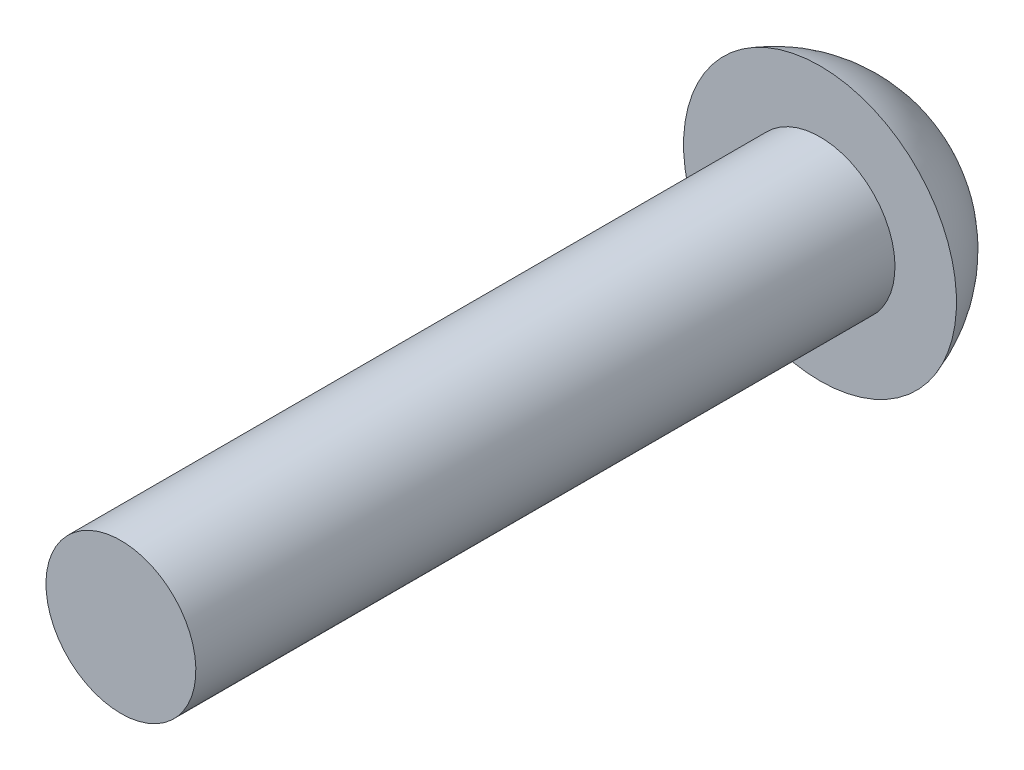
ISO-10303-21;
HEADER;
FILE_DESCRIPTION(('STEP AP214'),'2;1');
FILE_NAME('part.step','',(''),(''),'','','');
FILE_SCHEMA(('AUTOMOTIVE_DESIGN { 1 0 10303 214 1 1 1 1 }'));
ENDSEC;
DATA;
#1=APPLICATION_CONTEXT('core data for automotive mechanical design processes');
#2=APPLICATION_PROTOCOL_DEFINITION('international standard','automotive_design',2000,#1);
#3=PRODUCT_CONTEXT('',#1,'mechanical');
#4=PRODUCT('Part','Part','',(#3));
#5=PRODUCT_RELATED_PRODUCT_CATEGORY('part','',(#4));
#6=PRODUCT_DEFINITION_FORMATION('','',#4);
#7=PRODUCT_DEFINITION_CONTEXT('part definition',#1,'design');
#8=PRODUCT_DEFINITION('design','',#6,#7);
#9=PRODUCT_DEFINITION_SHAPE('','',#8);
#10=(LENGTH_UNIT() NAMED_UNIT(*) SI_UNIT(.MILLI.,.METRE.));
#11=(NAMED_UNIT(*) PLANE_ANGLE_UNIT() SI_UNIT($,.RADIAN.));
#12=(NAMED_UNIT(*) SI_UNIT($,.STERADIAN.) SOLID_ANGLE_UNIT());
#13=UNCERTAINTY_MEASURE_WITH_UNIT(LENGTH_MEASURE(1.E-05),#10,'distance_accuracy_value','');
#14=(GEOMETRIC_REPRESENTATION_CONTEXT(3) GLOBAL_UNCERTAINTY_ASSIGNED_CONTEXT((#13)) GLOBAL_UNIT_ASSIGNED_CONTEXT((#10,
#11,#12)) REPRESENTATION_CONTEXT('',''));
#15=CARTESIAN_POINT('',(0.,0.,0.));
#16=DIRECTION('',(0.,0.,1.));
#17=DIRECTION('',(1.,0.,0.));
#18=AXIS2_PLACEMENT_3D('',#15,#16,#17);
#19=CARTESIAN_POINT('',(0.,0.,-14.8445681818182));
#20=DIRECTION('',(0.,0.,1.));
#21=DIRECTION('',(0.,1.,0.));
#22=AXIS2_PLACEMENT_3D('',#19,#20,#21);
#23=SPHERICAL_SURFACE('',#22,3.26563181818182);
#24=CARTESIAN_POINT('',(0.,0.,-15.875));
#25=DIRECTION('',(0.,0.,1.));
#26=DIRECTION('',(0.,-1.,0.));
#27=AXIS2_PLACEMENT_3D('',#24,#25,#26);
#28=CIRCLE('',#27,3.0988);
#29=CARTESIAN_POINT('',(0.,-3.0988,-15.875));
#30=VERTEX_POINT('',#29);
#31=EDGE_CURVE('E10',#30,#30,#28,.T.);
#32=ORIENTED_EDGE('',*,*,#31,.F.);
#33=EDGE_LOOP('',(#32));
#34=FACE_BOUND('',#33,.T.);
#35=ADVANCED_FACE('F358',(#34),#23,.T.);
#36=CARTESIAN_POINT('',(0.,1.7018,-15.875));
#37=DIRECTION('',(0.,0.,-1.));
#38=DIRECTION('',(0.,1.,0.));
#39=AXIS2_PLACEMENT_3D('',#36,#37,#38);
#40=PLANE('',#39);
#41=CARTESIAN_POINT('',(0.,0.,-15.875));
#42=DIRECTION('',(0.,0.,1.));
#43=DIRECTION('',(0.,-1.,0.));
#44=AXIS2_PLACEMENT_3D('',#41,#42,#43);
#45=CIRCLE('',#44,1.7018);
#46=CARTESIAN_POINT('',(0.,-1.7018,-15.875));
#47=VERTEX_POINT('',#46);
#48=EDGE_CURVE('E364',#47,#47,#45,.T.);
#49=ORIENTED_EDGE('',*,*,#48,.F.);
#50=EDGE_LOOP('',(#49));
#51=FACE_BOUND('',#50,.T.);
#52=ORIENTED_EDGE('',*,*,#31,.T.);
#53=EDGE_LOOP('',(#52));
#54=FACE_BOUND('',#53,.T.);
#55=ADVANCED_FACE('F379',(#51,#54),#40,.F.);
#56=CARTESIAN_POINT('',(0.,0.,0.));
#57=DIRECTION('',(0.,0.,1.));
#58=DIRECTION('',(0.,-1.,0.));
#59=AXIS2_PLACEMENT_3D('',#56,#57,#58);
#60=CYLINDRICAL_SURFACE('',#59,1.7018);
#61=CARTESIAN_POINT('',(0.,0.,0.));
#62=DIRECTION('',(0.,0.,1.));
#63=DIRECTION('',(0.,-1.,0.));
#64=AXIS2_PLACEMENT_3D('',#61,#62,#63);
#65=CIRCLE('',#64,1.7018);
#66=CARTESIAN_POINT('',(0.,-1.7018,0.));
#67=VERTEX_POINT('',#66);
#68=EDGE_CURVE('E368',#67,#67,#65,.T.);
#69=ORIENTED_EDGE('',*,*,#68,.F.);
#70=EDGE_LOOP('',(#69));
#71=FACE_BOUND('',#70,.T.);
#72=ORIENTED_EDGE('',*,*,#48,.T.);
#73=EDGE_LOOP('',(#72));
#74=FACE_BOUND('',#73,.T.);
#75=ADVANCED_FACE('F377',(#71,#74),#60,.T.);
#76=CARTESIAN_POINT('',(0.,0.,0.));
#77=DIRECTION('',(0.,0.,-1.));
#78=DIRECTION('',(0.,1.,0.));
#79=AXIS2_PLACEMENT_3D('',#76,#77,#78);
#80=PLANE('',#79);
#81=ORIENTED_EDGE('',*,*,#68,.T.);
#82=EDGE_LOOP('',(#81));
#83=FACE_BOUND('',#82,.T.);
#84=ADVANCED_FACE('F375',(#83),#80,.F.);
#85=CLOSED_SHELL('',(#35,#55,#75,#84));
#86=MANIFOLD_SOLID_BREP('B2',#85);
#87=ADVANCED_BREP_SHAPE_REPRESENTATION('',(#18,#86),#14);
#88=SHAPE_DEFINITION_REPRESENTATION(#9,#87);
ENDSEC;
END-ISO-10303-21;
